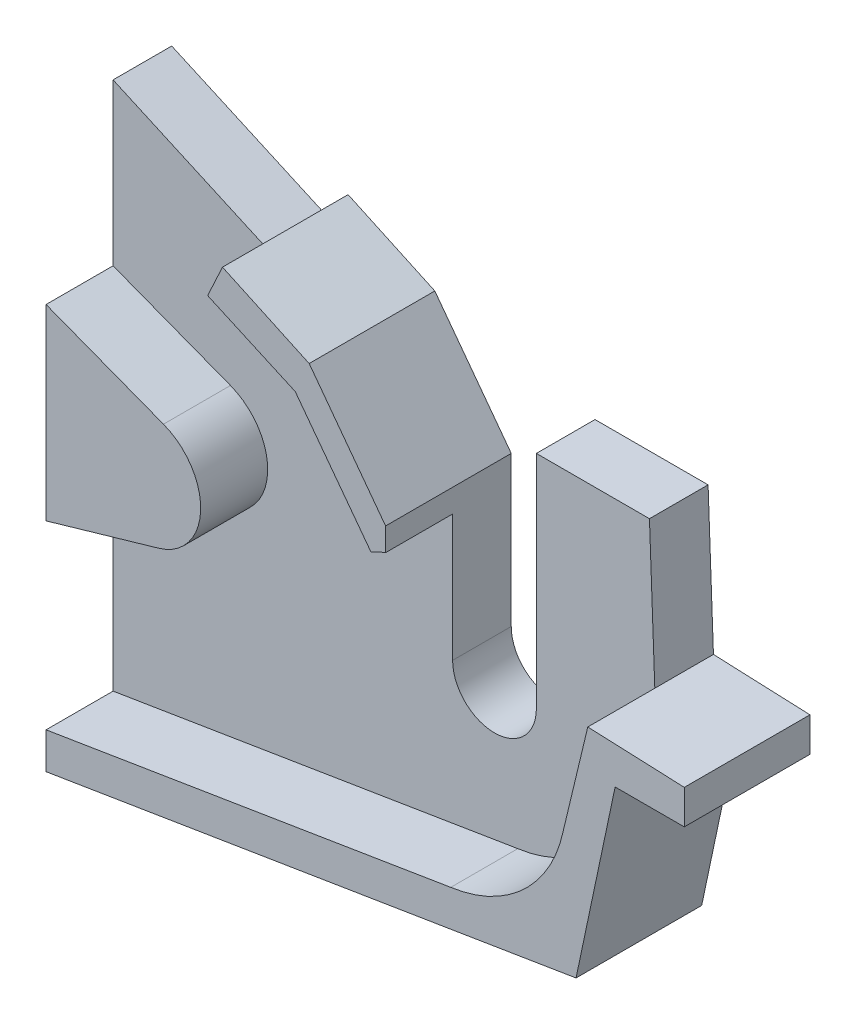
ISO-10303-21;
HEADER;
FILE_DESCRIPTION(('STEP AP214'),'2;1');
FILE_NAME('part.step','',(''),(''),'','','');
FILE_SCHEMA(('AUTOMOTIVE_DESIGN { 1 0 10303 214 1 1 1 1 }'));
ENDSEC;
DATA;
#1=APPLICATION_CONTEXT('core data for automotive mechanical design processes');
#2=APPLICATION_PROTOCOL_DEFINITION('international standard','automotive_design',2000,#1);
#3=PRODUCT_CONTEXT('',#1,'mechanical');
#4=PRODUCT('Part','Part','',(#3));
#5=PRODUCT_RELATED_PRODUCT_CATEGORY('part','',(#4));
#6=PRODUCT_DEFINITION_FORMATION('','',#4);
#7=PRODUCT_DEFINITION_CONTEXT('part definition',#1,'design');
#8=PRODUCT_DEFINITION('design','',#6,#7);
#9=PRODUCT_DEFINITION_SHAPE('','',#8);
#10=(LENGTH_UNIT() NAMED_UNIT(*) SI_UNIT(.MILLI.,.METRE.));
#11=(NAMED_UNIT(*) PLANE_ANGLE_UNIT() SI_UNIT($,.RADIAN.));
#12=(NAMED_UNIT(*) SI_UNIT($,.STERADIAN.) SOLID_ANGLE_UNIT());
#13=UNCERTAINTY_MEASURE_WITH_UNIT(LENGTH_MEASURE(1.E-05),#10,'distance_accuracy_value','');
#14=(GEOMETRIC_REPRESENTATION_CONTEXT(3) GLOBAL_UNCERTAINTY_ASSIGNED_CONTEXT((#13)) GLOBAL_UNIT_ASSIGNED_CONTEXT((#10,
#11,#12)) REPRESENTATION_CONTEXT('',''));
#15=CARTESIAN_POINT('',(0.,0.,0.));
#16=DIRECTION('',(0.,0.,1.));
#17=DIRECTION('',(1.,0.,0.));
#18=AXIS2_PLACEMENT_3D('',#15,#16,#17);
#19=CARTESIAN_POINT('',(0.,0.,7.));
#20=DIRECTION('',(0.,0.,1.));
#21=DIRECTION('',(1.,0.,0.));
#22=AXIS2_PLACEMENT_3D('',#19,#20,#21);
#23=PLANE('',#22);
#24=DIRECTION('',(-0.986991690227506,-0.160771276731423,0.));
#25=VECTOR('',#24,1.);
#26=CARTESIAN_POINT('',(2.22802353362368,-13.6780696031388,7.));
#27=LINE('',#26,#25);
#28=CARTESIAN_POINT('',(6.86912561146139,-12.9220795437668,7.));
#29=VERTEX_POINT('',#28);
#30=CARTESIAN_POINT('',(-41.4462123020663,-20.7921747421138,7.));
#31=VERTEX_POINT('',#30);
#32=EDGE_CURVE('E320',#29,#31,#27,.T.);
#33=ORIENTED_EDGE('',*,*,#32,.F.);
#34=CARTESIAN_POINT('',(4.68782168795325,2.86623605071615,7.));
#35=DIRECTION('',(0.,0.,1.));
#36=DIRECTION('',(1.,0.,0.));
#37=AXIS2_PLACEMENT_3D('',#34,#35,#36);
#38=CIRCLE('',#37,15.9382871136676);
#39=CARTESIAN_POINT('',(20.2892733707284,-0.393165966178356,7.));
#40=VERTEX_POINT('',#39);
#41=EDGE_CURVE('E259',#40,#29,#38,.F.);
#42=ORIENTED_EDGE('',*,*,#41,.F.);
#43=DIRECTION('',(0.233360215526109,0.972390358760106,0.));
#44=VECTOR('',#43,1.);
#45=CARTESIAN_POINT('',(19.2735967393053,-4.62539621925356,7.));
#46=LINE('',#45,#44);
#47=CARTESIAN_POINT('',(23.2245967998316,11.83805432074,7.));
#48=VERTEX_POINT('',#47);
#49=EDGE_CURVE('E264',#40,#48,#46,.T.);
#50=ORIENTED_EDGE('',*,*,#49,.T.);
#51=DIRECTION('',(0.0370621633835116,-0.999312962012069,0.));
#52=VECTOR('',#51,1.);
#53=CARTESIAN_POINT('',(23.6311378714714,0.87642322878244,7.));
#54=LINE('',#53,#52);
#55=CARTESIAN_POINT('',(22.5861708374071,29.0520343287084,7.));
#56=VERTEX_POINT('',#55);
#57=EDGE_CURVE('E414',#56,#48,#54,.T.);
#58=ORIENTED_EDGE('',*,*,#57,.F.);
#59=DIRECTION('',(1.,0.,0.));
#60=VECTOR('',#59,1.);
#61=CARTESIAN_POINT('',(0.,29.0520343287084,7.));
#62=LINE('',#61,#60);
#63=CARTESIAN_POINT('',(9.0861708374071,29.0520343287084,7.));
#64=VERTEX_POINT('',#63);
#65=EDGE_CURVE('E418',#64,#56,#62,.T.);
#66=ORIENTED_EDGE('',*,*,#65,.F.);
#67=DIRECTION('',(0.,1.,0.));
#68=VECTOR('',#67,1.);
#69=CARTESIAN_POINT('',(9.0861708374071,0.,7.));
#70=LINE('',#69,#68);
#71=CARTESIAN_POINT('',(9.0861708374071,2.65462230757975,7.));
#72=VERTEX_POINT('',#71);
#73=EDGE_CURVE('E423',#72,#64,#70,.T.);
#74=ORIENTED_EDGE('',*,*,#73,.F.);
#75=CARTESIAN_POINT('',(4.0861708374071,2.65462230757975,7.));
#76=DIRECTION('',(0.,0.,1.));
#77=DIRECTION('',(1.,0.,0.));
#78=AXIS2_PLACEMENT_3D('',#75,#76,#77);
#79=CIRCLE('',#78,5.);
#80=CARTESIAN_POINT('',(-0.913829162592902,2.65462230757975,7.));
#81=VERTEX_POINT('',#80);
#82=EDGE_CURVE('E427',#81,#72,#79,.T.);
#83=ORIENTED_EDGE('',*,*,#82,.F.);
#84=DIRECTION('',(0.,1.,0.));
#85=VECTOR('',#84,1.);
#86=CARTESIAN_POINT('',(-0.913829162592902,0.,7.));
#87=LINE('',#86,#85);
#88=CARTESIAN_POINT('',(-0.913829162592902,17.7877139891202,7.));
#89=VERTEX_POINT('',#88);
#90=EDGE_CURVE('E102',#81,#89,#87,.T.);
#91=ORIENTED_EDGE('',*,*,#90,.T.);
#92=CARTESIAN_POINT('',(4.68782168795325,2.86623605071615,7.));
#93=DIRECTION('',(0.,0.,1.));
#94=DIRECTION('',(1.,0.,0.));
#95=AXIS2_PLACEMENT_3D('',#92,#93,#94);
#96=CIRCLE('',#95,15.9382871136676);
#97=CARTESIAN_POINT('',(-2.67291578952691,17.0030157372403,7.));
#98=VERTEX_POINT('',#97);
#99=EDGE_CURVE('E372',#98,#89,#96,.F.);
#100=ORIENTED_EDGE('',*,*,#99,.F.);
#101=DIRECTION('',(0.599518185561964,-0.800361134226601,0.));
#102=VECTOR('',#101,1.);
#103=CARTESIAN_POINT('',(6.44636407504535,4.82871085123035,7.));
#104=LINE('',#103,#102);
#105=CARTESIAN_POINT('',(-11.6983487532847,29.0520343287084,7.));
#106=VERTEX_POINT('',#105);
#107=EDGE_CURVE('E96',#106,#98,#104,.T.);
#108=ORIENTED_EDGE('',*,*,#107,.F.);
#109=DIRECTION('',(-0.912307213221426,0.409506469673137,0.));
#110=VECTOR('',#109,1.);
#111=CARTESIAN_POINT('',(8.89195426682854,19.8096846277857,7.));
#112=LINE('',#111,#110);
#113=CARTESIAN_POINT('',(-22.1550900037522,33.7457418120067,7.));
#114=VERTEX_POINT('',#113);
#115=EDGE_CURVE('E369',#106,#114,#112,.T.);
#116=ORIENTED_EDGE('',*,*,#115,.T.);
#117=DIRECTION('',(0.912307213221426,-0.409506469673137,0.));
#118=VECTOR('',#117,1.);
#119=CARTESIAN_POINT('',(8.89195426682854,19.8096846277857,7.));
#120=LINE('',#119,#118);
#121=CARTESIAN_POINT('',(-41.4462123020663,42.4049295000229,7.));
#122=VERTEX_POINT('',#121);
#123=EDGE_CURVE('E433',#122,#114,#120,.T.);
#124=ORIENTED_EDGE('',*,*,#123,.F.);
#125=DIRECTION('',(0.,-1.,0.));
#126=VECTOR('',#125,1.);
#127=CARTESIAN_POINT('',(-41.4462123020663,0.,7.));
#128=LINE('',#127,#126);
#129=CARTESIAN_POINT('',(-41.4462123020663,23.1809754877137,7.));
#130=VERTEX_POINT('',#129);
#131=EDGE_CURVE('E438',#122,#130,#128,.T.);
#132=ORIENTED_EDGE('',*,*,#131,.T.);
#133=DIRECTION('',(-0.933859309772782,0.357640587113241,0.));
#134=VECTOR('',#133,1.);
#135=CARTESIAN_POINT('',(2.44086913521748,6.37351701119464,7.));
#136=LINE('',#135,#134);
#137=CARTESIAN_POINT('',(-27.4304834133616,17.8133644823729,7.));
#138=VERTEX_POINT('',#137);
#139=EDGE_CURVE('E410',#138,#130,#136,.T.);
#140=ORIENTED_EDGE('',*,*,#139,.F.);
#141=CARTESIAN_POINT('',(-29.9039838978348,11.3546415678472,7.));
#142=DIRECTION('',(0.,0.,1.));
#143=DIRECTION('',(1.,0.,0.));
#144=AXIS2_PLACEMENT_3D('',#141,#142,#143);
#145=CIRCLE('',#144,6.91616268846454);
#146=CARTESIAN_POINT('',(-27.9913406044106,4.70820628527434,7.));
#147=VERTEX_POINT('',#146);
#148=EDGE_CURVE('E402',#138,#147,#145,.F.);
#149=ORIENTED_EDGE('',*,*,#148,.T.);
#150=DIRECTION('',(-0.960443575653902,-0.278474663093696,0.));
#151=VECTOR('',#150,1.);
#152=CARTESIAN_POINT('',(-3.42992943549239,11.8296352517949,7.));
#153=LINE('',#152,#151);
#154=CARTESIAN_POINT('',(-41.4462123020663,0.807049613553603,7.));
#155=VERTEX_POINT('',#154);
#156=EDGE_CURVE('E406',#147,#155,#153,.T.);
#157=ORIENTED_EDGE('',*,*,#156,.T.);
#158=EDGE_CURVE('E437',#155,#31,#128,.T.);
#159=ORIENTED_EDGE('',*,*,#158,.T.);
#160=EDGE_LOOP('',(#33,#42,#50,#58,#66,#74,#83,#91,#100,#108,#116,#124,#132,#140,#149,#157,#159));
#161=FACE_BOUND('',#160,.T.);
#162=ADVANCED_FACE('F80',(#161),#23,.T.);
#163=CARTESIAN_POINT('',(0.536724699134198,12.7901277892678,7.));
#164=DIRECTION('',(0.0419270824807038,0.999120673269579,0.));
#165=DIRECTION('',(-0.999120673269579,0.0419270824807038,0.));
#166=AXIS2_PLACEMENT_3D('',#163,#164,#165);
#167=PLANE('',#166);
#168=DIRECTION('',(0.999120673269579,-0.0419270824807038,0.));
#169=VECTOR('',#168,1.);
#170=CARTESIAN_POINT('',(0.536724699134198,12.7901277892678,0.));
#171=LINE('',#170,#169);
#172=CARTESIAN_POINT('',(23.2245967998316,11.83805432074,0.));
#173=VERTEX_POINT('',#172);
#174=CARTESIAN_POINT('',(34.744303122736,11.3546415658289,0.));
#175=VERTEX_POINT('',#174);
#176=EDGE_CURVE('E413',#173,#175,#171,.T.);
#177=ORIENTED_EDGE('',*,*,#176,.F.);
#178=DIRECTION('',(0.,0.,-1.));
#179=VECTOR('',#178,1.);
#180=CARTESIAN_POINT('',(23.2245967998316,11.83805432074,7.));
#181=LINE('',#180,#179);
#182=EDGE_CURVE('E12',#48,#173,#181,.T.);
#183=ORIENTED_EDGE('',*,*,#182,.F.);
#184=DIRECTION('',(0.,0.,-1.));
#185=VECTOR('',#184,1.);
#186=CARTESIAN_POINT('',(23.2245967998316,11.83805432074,15.));
#187=LINE('',#186,#185);
#188=CARTESIAN_POINT('',(23.2245967998316,11.83805432074,15.));
#189=VERTEX_POINT('',#188);
#190=EDGE_CURVE('E312',#189,#48,#187,.T.);
#191=ORIENTED_EDGE('',*,*,#190,.F.);
#192=DIRECTION('',(0.999120673269579,-0.0419270824807038,0.));
#193=VECTOR('',#192,1.);
#194=CARTESIAN_POINT('',(0.536724699134198,12.7901277892678,15.));
#195=LINE('',#194,#193);
#196=CARTESIAN_POINT('',(34.744303122736,11.3546415658289,15.));
#197=VERTEX_POINT('',#196);
#198=EDGE_CURVE('E303',#189,#197,#195,.T.);
#199=ORIENTED_EDGE('',*,*,#198,.T.);
#200=DIRECTION('',(0.,0.,-1.));
#201=VECTOR('',#200,1.);
#202=CARTESIAN_POINT('',(34.744303122736,11.3546415658289,7.));
#203=LINE('',#202,#201);
#204=EDGE_CURVE('E442',#197,#175,#203,.T.);
#205=ORIENTED_EDGE('',*,*,#204,.T.);
#206=EDGE_LOOP('',(#177,#183,#191,#199,#205));
#207=FACE_BOUND('',#206,.T.);
#208=ADVANCED_FACE('F82',(#207),#167,.T.);
#209=CARTESIAN_POINT('',(23.6311378714714,0.87642322878244,7.));
#210=DIRECTION('',(0.999312962012069,0.0370621633835116,0.));
#211=DIRECTION('',(-0.0370621633835116,0.999312962012069,0.));
#212=AXIS2_PLACEMENT_3D('',#209,#210,#211);
#213=PLANE('',#212);
#214=DIRECTION('',(0.0370621633835116,-0.999312962012069,0.));
#215=VECTOR('',#214,1.);
#216=CARTESIAN_POINT('',(23.6311378714714,0.87642322878244,0.));
#217=LINE('',#216,#215);
#218=CARTESIAN_POINT('',(22.5861708374071,29.0520343287084,0.));
#219=VERTEX_POINT('',#218);
#220=EDGE_CURVE('E446',#219,#173,#217,.T.);
#221=ORIENTED_EDGE('',*,*,#220,.F.);
#222=DIRECTION('',(0.,0.,-1.));
#223=VECTOR('',#222,1.);
#224=CARTESIAN_POINT('',(22.5861708374071,29.0520343287084,7.));
#225=LINE('',#224,#223);
#226=EDGE_CURVE('E89',#56,#219,#225,.T.);
#227=ORIENTED_EDGE('',*,*,#226,.F.);
#228=ORIENTED_EDGE('',*,*,#57,.T.);
#229=ORIENTED_EDGE('',*,*,#182,.T.);
#230=EDGE_LOOP('',(#221,#227,#228,#229));
#231=FACE_BOUND('',#230,.T.);
#232=ADVANCED_FACE('F546',(#231),#213,.T.);
#233=CARTESIAN_POINT('',(0.,29.0520343287084,7.));
#234=DIRECTION('',(0.,1.,0.));
#235=DIRECTION('',(0.,0.,1.));
#236=AXIS2_PLACEMENT_3D('',#233,#234,#235);
#237=PLANE('',#236);
#238=DIRECTION('',(1.,0.,0.));
#239=VECTOR('',#238,1.);
#240=CARTESIAN_POINT('',(0.,29.0520343287084,0.));
#241=LINE('',#240,#239);
#242=CARTESIAN_POINT('',(9.0861708374071,29.0520343287084,0.));
#243=VERTEX_POINT('',#242);
#244=EDGE_CURVE('E450',#243,#219,#241,.T.);
#245=ORIENTED_EDGE('',*,*,#244,.F.);
#246=DIRECTION('',(0.,0.,-1.));
#247=VECTOR('',#246,1.);
#248=CARTESIAN_POINT('',(9.0861708374071,29.0520343287084,7.));
#249=LINE('',#248,#247);
#250=EDGE_CURVE('E536',#64,#243,#249,.T.);
#251=ORIENTED_EDGE('',*,*,#250,.F.);
#252=ORIENTED_EDGE('',*,*,#65,.T.);
#253=ORIENTED_EDGE('',*,*,#226,.T.);
#254=EDGE_LOOP('',(#245,#251,#252,#253));
#255=FACE_BOUND('',#254,.T.);
#256=ADVANCED_FACE('F542',(#255),#237,.T.);
#257=CARTESIAN_POINT('',(9.0861708374071,0.,7.));
#258=DIRECTION('',(-1.,0.,0.));
#259=DIRECTION('',(0.,0.,1.));
#260=AXIS2_PLACEMENT_3D('',#257,#258,#259);
#261=PLANE('',#260);
#262=DIRECTION('',(0.,1.,0.));
#263=VECTOR('',#262,1.);
#264=CARTESIAN_POINT('',(9.0861708374071,0.,0.));
#265=LINE('',#264,#263);
#266=CARTESIAN_POINT('',(9.0861708374071,2.65462230757975,0.));
#267=VERTEX_POINT('',#266);
#268=EDGE_CURVE('E454',#267,#243,#265,.T.);
#269=ORIENTED_EDGE('',*,*,#268,.F.);
#270=DIRECTION('',(0.,0.,-1.));
#271=VECTOR('',#270,1.);
#272=CARTESIAN_POINT('',(9.0861708374071,2.65462230757975,7.));
#273=LINE('',#272,#271);
#274=EDGE_CURVE('E533',#72,#267,#273,.T.);
#275=ORIENTED_EDGE('',*,*,#274,.F.);
#276=ORIENTED_EDGE('',*,*,#73,.T.);
#277=ORIENTED_EDGE('',*,*,#250,.T.);
#278=EDGE_LOOP('',(#269,#275,#276,#277));
#279=FACE_BOUND('',#278,.T.);
#280=ADVANCED_FACE('F556',(#279),#261,.T.);
#281=CARTESIAN_POINT('',(4.0861708374071,2.65462230757975,7.));
#282=DIRECTION('',(0.,0.,-1.));
#283=DIRECTION('',(-1.,0.,0.));
#284=AXIS2_PLACEMENT_3D('',#281,#282,#283);
#285=CYLINDRICAL_SURFACE('',#284,5.);
#286=CARTESIAN_POINT('',(4.0861708374071,2.65462230757975,0.));
#287=DIRECTION('',(0.,0.,1.));
#288=DIRECTION('',(1.,0.,0.));
#289=AXIS2_PLACEMENT_3D('',#286,#287,#288);
#290=CIRCLE('',#289,5.);
#291=CARTESIAN_POINT('',(-0.913829162592902,2.65462230757975,0.));
#292=VERTEX_POINT('',#291);
#293=EDGE_CURVE('E458',#292,#267,#290,.T.);
#294=ORIENTED_EDGE('',*,*,#293,.F.);
#295=DIRECTION('',(0.,0.,-1.));
#296=VECTOR('',#295,1.);
#297=CARTESIAN_POINT('',(-0.913829162592902,2.65462230757975,7.));
#298=LINE('',#297,#296);
#299=EDGE_CURVE('E530',#81,#292,#298,.T.);
#300=ORIENTED_EDGE('',*,*,#299,.F.);
#301=ORIENTED_EDGE('',*,*,#82,.T.);
#302=ORIENTED_EDGE('',*,*,#274,.T.);
#303=EDGE_LOOP('',(#294,#300,#301,#302));
#304=FACE_BOUND('',#303,.T.);
#305=ADVANCED_FACE('F603',(#304),#285,.F.);
#306=CARTESIAN_POINT('',(-0.913829162592902,0.,7.));
#307=DIRECTION('',(-1.,0.,0.));
#308=DIRECTION('',(0.,0.,1.));
#309=AXIS2_PLACEMENT_3D('',#306,#307,#308);
#310=PLANE('',#309);
#311=DIRECTION('',(0.,1.,0.));
#312=VECTOR('',#311,1.);
#313=CARTESIAN_POINT('',(-0.913829162592902,0.,0.));
#314=LINE('',#313,#312);
#315=CARTESIAN_POINT('',(-0.913829162592902,20.5504620382955,0.));
#316=VERTEX_POINT('',#315);
#317=EDGE_CURVE('E462',#292,#316,#314,.T.);
#318=ORIENTED_EDGE('',*,*,#317,.T.);
#319=DIRECTION('',(0.,0.,-1.));
#320=VECTOR('',#319,1.);
#321=CARTESIAN_POINT('',(-0.913829162592902,20.5504620382955,7.));
#322=LINE('',#321,#320);
#323=CARTESIAN_POINT('',(-0.913829162592902,20.5504620382955,15.));
#324=VERTEX_POINT('',#323);
#325=EDGE_CURVE('E526',#324,#316,#322,.T.);
#326=ORIENTED_EDGE('',*,*,#325,.F.);
#327=DIRECTION('',(0.,1.,0.));
#328=VECTOR('',#327,1.);
#329=CARTESIAN_POINT('',(-0.913829162592902,0.,15.));
#330=LINE('',#329,#328);
#331=CARTESIAN_POINT('',(-0.913829162592902,17.7877139891202,15.));
#332=VERTEX_POINT('',#331);
#333=EDGE_CURVE('E329',#332,#324,#330,.T.);
#334=ORIENTED_EDGE('',*,*,#333,.F.);
#335=DIRECTION('',(0.,0.,-1.));
#336=VECTOR('',#335,1.);
#337=CARTESIAN_POINT('',(-0.913829162592902,17.7877139891202,15.));
#338=LINE('',#337,#336);
#339=EDGE_CURVE('E363',#332,#89,#338,.T.);
#340=ORIENTED_EDGE('',*,*,#339,.T.);
#341=ORIENTED_EDGE('',*,*,#90,.F.);
#342=ORIENTED_EDGE('',*,*,#299,.T.);
#343=EDGE_LOOP('',(#318,#326,#334,#340,#341,#342));
#344=FACE_BOUND('',#343,.T.);
#345=ADVANCED_FACE('F604',(#344),#310,.F.);
#346=CARTESIAN_POINT('',(9.26114189402648,6.90647430874386,7.));
#347=DIRECTION('',(-0.801633281882219,-0.597816093275133,0.));
#348=DIRECTION('',(0.597816093275133,-0.801633281882219,0.));
#349=AXIS2_PLACEMENT_3D('',#346,#347,#348);
#350=PLANE('',#349);
#351=DIRECTION('',(-0.597816093275133,0.801633281882219,0.));
#352=VECTOR('',#351,1.);
#353=CARTESIAN_POINT('',(9.26114189402648,6.90647430874386,0.));
#354=LINE('',#353,#352);
#355=CARTESIAN_POINT('',(-10.0368202056355,32.7838116129957,0.));
#356=VERTEX_POINT('',#355);
#357=EDGE_CURVE('E465',#316,#356,#354,.T.);
#358=ORIENTED_EDGE('',*,*,#357,.T.);
#359=DIRECTION('',(0.,0.,-1.));
#360=VECTOR('',#359,1.);
#361=CARTESIAN_POINT('',(-10.0368202056355,32.7838116129957,7.));
#362=LINE('',#361,#360);
#363=CARTESIAN_POINT('',(-10.0368202056355,32.7838116129957,15.));
#364=VERTEX_POINT('',#363);
#365=EDGE_CURVE('E522',#364,#356,#362,.T.);
#366=ORIENTED_EDGE('',*,*,#365,.F.);
#367=DIRECTION('',(-0.597816093275133,0.801633281882219,0.));
#368=VECTOR('',#367,1.);
#369=CARTESIAN_POINT('',(9.26114189402648,6.90647430874386,15.));
#370=LINE('',#369,#368);
#371=EDGE_CURVE('E333',#324,#364,#370,.T.);
#372=ORIENTED_EDGE('',*,*,#371,.F.);
#373=ORIENTED_EDGE('',*,*,#325,.T.);
#374=EDGE_LOOP('',(#358,#366,#372,#373));
#375=FACE_BOUND('',#374,.T.);
#376=ADVANCED_FACE('F600',(#375),#350,.F.);
#377=CARTESIAN_POINT('',(10.7214720768776,23.1841900245257,7.));
#378=DIRECTION('',(-0.419738295272975,-0.907645174879114,0.));
#379=DIRECTION('',(0.907645174879114,-0.419738295272975,0.));
#380=AXIS2_PLACEMENT_3D('',#377,#378,#379);
#381=PLANE('',#380);
#382=DIRECTION('',(-0.907645174879114,0.419738295272975,0.));
#383=VECTOR('',#382,1.);
#384=CARTESIAN_POINT('',(10.7214720768776,23.1841900245257,0.));
#385=LINE('',#384,#383);
#386=CARTESIAN_POINT('',(-20.3865602199569,37.5700236156193,0.));
#387=VERTEX_POINT('',#386);
#388=EDGE_CURVE('E468',#356,#387,#385,.T.);
#389=ORIENTED_EDGE('',*,*,#388,.T.);
#390=DIRECTION('',(0.,0.,-1.));
#391=VECTOR('',#390,1.);
#392=CARTESIAN_POINT('',(-20.3865602199569,37.5700236156193,7.));
#393=LINE('',#392,#391);
#394=CARTESIAN_POINT('',(-20.3865602199569,37.5700236156193,15.));
#395=VERTEX_POINT('',#394);
#396=EDGE_CURVE('E518',#395,#387,#393,.T.);
#397=ORIENTED_EDGE('',*,*,#396,.F.);
#398=DIRECTION('',(-0.907645174879114,0.419738295272975,0.));
#399=VECTOR('',#398,1.);
#400=CARTESIAN_POINT('',(10.7214720768776,23.1841900245257,15.));
#401=LINE('',#400,#399);
#402=EDGE_CURVE('E337',#364,#395,#401,.T.);
#403=ORIENTED_EDGE('',*,*,#402,.F.);
#404=ORIENTED_EDGE('',*,*,#365,.T.);
#405=EDGE_LOOP('',(#389,#397,#403,#404));
#406=FACE_BOUND('',#405,.T.);
#407=ADVANCED_FACE('F593',(#406),#381,.F.);
#408=CARTESIAN_POINT('',(-31.1080322968345,14.3858335910936,7.));
#409=DIRECTION('',(0.907645174879114,-0.419738295272975,0.));
#410=DIRECTION('',(0.419738295272975,0.907645174879114,0.));
#411=AXIS2_PLACEMENT_3D('',#408,#409,#410);
#412=PLANE('',#411);
#413=DIRECTION('',(-0.419738295272975,-0.907645174879114,0.));
#414=VECTOR('',#413,1.);
#415=CARTESIAN_POINT('',(-31.1080322968345,14.3858335910936,0.));
#416=LINE('',#415,#414);
#417=CARTESIAN_POINT('',(-22.1550900037522,33.7457418120067,0.));
#418=VERTEX_POINT('',#417);
#419=EDGE_CURVE('E471',#387,#418,#416,.T.);
#420=ORIENTED_EDGE('',*,*,#419,.T.);
#421=DIRECTION('',(0.,0.,-1.));
#422=VECTOR('',#421,1.);
#423=CARTESIAN_POINT('',(-22.1550900037522,33.7457418120067,7.));
#424=LINE('',#423,#422);
#425=EDGE_CURVE('E515',#114,#418,#424,.T.);
#426=ORIENTED_EDGE('',*,*,#425,.F.);
#427=DIRECTION('',(0.,0.,-1.));
#428=VECTOR('',#427,1.);
#429=CARTESIAN_POINT('',(-22.1550900037522,33.7457418120067,15.));
#430=LINE('',#429,#428);
#431=CARTESIAN_POINT('',(-22.1550900037522,33.7457418120067,15.));
#432=VERTEX_POINT('',#431);
#433=EDGE_CURVE('E359',#432,#114,#430,.T.);
#434=ORIENTED_EDGE('',*,*,#433,.F.);
#435=DIRECTION('',(-0.419738295272975,-0.907645174879114,0.));
#436=VECTOR('',#435,1.);
#437=CARTESIAN_POINT('',(-31.1080322968345,14.3858335910936,15.));
#438=LINE('',#437,#436);
#439=EDGE_CURVE('E341',#395,#432,#438,.T.);
#440=ORIENTED_EDGE('',*,*,#439,.F.);
#441=ORIENTED_EDGE('',*,*,#396,.T.);
#442=EDGE_LOOP('',(#420,#426,#434,#440,#441));
#443=FACE_BOUND('',#442,.T.);
#444=ADVANCED_FACE('F588',(#443),#412,.F.);
#445=CARTESIAN_POINT('',(8.89195426682854,19.8096846277857,7.));
#446=DIRECTION('',(0.409506469673137,0.912307213221426,0.));
#447=DIRECTION('',(-0.912307213221426,0.409506469673137,0.));
#448=AXIS2_PLACEMENT_3D('',#445,#446,#447);
#449=PLANE('',#448);
#450=DIRECTION('',(0.912307213221426,-0.409506469673137,0.));
#451=VECTOR('',#450,1.);
#452=CARTESIAN_POINT('',(8.89195426682854,19.8096846277857,0.));
#453=LINE('',#452,#451);
#454=CARTESIAN_POINT('',(-41.4462123020663,42.4049295000229,0.));
#455=VERTEX_POINT('',#454);
#456=EDGE_CURVE('E475',#455,#418,#453,.T.);
#457=ORIENTED_EDGE('',*,*,#456,.F.);
#458=DIRECTION('',(0.,0.,-1.));
#459=VECTOR('',#458,1.);
#460=CARTESIAN_POINT('',(-41.4462123020663,42.4049295000229,7.));
#461=LINE('',#460,#459);
#462=EDGE_CURVE('E512',#122,#455,#461,.T.);
#463=ORIENTED_EDGE('',*,*,#462,.F.);
#464=ORIENTED_EDGE('',*,*,#123,.T.);
#465=ORIENTED_EDGE('',*,*,#425,.T.);
#466=EDGE_LOOP('',(#457,#463,#464,#465));
#467=FACE_BOUND('',#466,.T.);
#468=ADVANCED_FACE('F582',(#467),#449,.T.);
#469=CARTESIAN_POINT('',(-41.4462123020663,0.,7.));
#470=DIRECTION('',(1.,0.,0.));
#471=DIRECTION('',(0.,1.,0.));
#472=AXIS2_PLACEMENT_3D('',#469,#470,#471);
#473=PLANE('',#472);
#474=DIRECTION('',(0.,-1.,0.));
#475=VECTOR('',#474,1.);
#476=CARTESIAN_POINT('',(-41.4462123020663,0.,0.));
#477=LINE('',#476,#475);
#478=CARTESIAN_POINT('',(-41.4462123020663,-25.1234009808684,0.));
#479=VERTEX_POINT('',#478);
#480=EDGE_CURVE('E479',#455,#479,#477,.T.);
#481=ORIENTED_EDGE('',*,*,#480,.T.);
#482=DIRECTION('',(0.,0.,-1.));
#483=VECTOR('',#482,1.);
#484=CARTESIAN_POINT('',(-41.4462123020663,-25.1234009808684,7.));
#485=LINE('',#484,#483);
#486=CARTESIAN_POINT('',(-41.4462123020663,-25.1234009808684,15.));
#487=VERTEX_POINT('',#486);
#488=EDGE_CURVE('E508',#487,#479,#485,.T.);
#489=ORIENTED_EDGE('',*,*,#488,.F.);
#490=DIRECTION('',(0.,-1.,0.));
#491=VECTOR('',#490,1.);
#492=CARTESIAN_POINT('',(-41.4462123020663,0.,15.));
#493=LINE('',#492,#491);
#494=CARTESIAN_POINT('',(-41.4462123020663,-20.7921747421138,15.));
#495=VERTEX_POINT('',#494);
#496=EDGE_CURVE('E282',#495,#487,#493,.T.);
#497=ORIENTED_EDGE('',*,*,#496,.F.);
#498=DIRECTION('',(0.,0.,-1.));
#499=VECTOR('',#498,1.);
#500=CARTESIAN_POINT('',(-41.4462123020663,-20.7921747421138,15.));
#501=LINE('',#500,#499);
#502=EDGE_CURVE('E265',#495,#31,#501,.T.);
#503=ORIENTED_EDGE('',*,*,#502,.T.);
#504=ORIENTED_EDGE('',*,*,#158,.F.);
#505=DIRECTION('',(0.,0.,-1.));
#506=VECTOR('',#505,1.);
#507=CARTESIAN_POINT('',(-41.4462123020663,0.807049613553603,15.));
#508=LINE('',#507,#506);
#509=CARTESIAN_POINT('',(-41.4462123020663,0.807049613553603,15.));
#510=VERTEX_POINT('',#509);
#511=EDGE_CURVE('E395',#510,#155,#508,.T.);
#512=ORIENTED_EDGE('',*,*,#511,.F.);
#513=DIRECTION('',(0.,-1.,0.));
#514=VECTOR('',#513,1.);
#515=CARTESIAN_POINT('',(-41.4462123020663,0.,15.));
#516=LINE('',#515,#514);
#517=CARTESIAN_POINT('',(-41.4462123020663,23.1809754877137,15.));
#518=VERTEX_POINT('',#517);
#519=EDGE_CURVE('E379',#518,#510,#516,.T.);
#520=ORIENTED_EDGE('',*,*,#519,.F.);
#521=DIRECTION('',(0.,0.,-1.));
#522=VECTOR('',#521,1.);
#523=CARTESIAN_POINT('',(-41.4462123020663,23.1809754877137,15.));
#524=LINE('',#523,#522);
#525=EDGE_CURVE('E398',#518,#130,#524,.T.);
#526=ORIENTED_EDGE('',*,*,#525,.T.);
#527=ORIENTED_EDGE('',*,*,#131,.F.);
#528=ORIENTED_EDGE('',*,*,#462,.T.);
#529=EDGE_LOOP('',(#481,#489,#497,#503,#504,#512,#520,#526,#527,#528));
#530=FACE_BOUND('',#529,.T.);
#531=ADVANCED_FACE('F578',(#530),#473,.F.);
#532=CARTESIAN_POINT('',(2.9153021414019,-17.8973448899889,7.));
#533=DIRECTION('',(-0.160771276731423,0.986991690227506,0.));
#534=DIRECTION('',(-0.986991690227506,-0.160771276731423,0.));
#535=AXIS2_PLACEMENT_3D('',#532,#533,#534);
#536=PLANE('',#535);
#537=DIRECTION('',(0.986991690227506,0.160771276731423,0.));
#538=VECTOR('',#537,1.);
#539=CARTESIAN_POINT('',(2.9153021414019,-17.8973448899889,0.));
#540=LINE('',#539,#538);
#541=CARTESIAN_POINT('',(21.8226728247008,-14.8175194421297,0.));
#542=VERTEX_POINT('',#541);
#543=EDGE_CURVE('E482',#479,#542,#540,.T.);
#544=ORIENTED_EDGE('',*,*,#543,.T.);
#545=DIRECTION('',(0.,0.,-1.));
#546=VECTOR('',#545,1.);
#547=CARTESIAN_POINT('',(21.8226728247008,-14.8175194421297,7.));
#548=LINE('',#547,#546);
#549=CARTESIAN_POINT('',(21.8226728247008,-14.8175194421297,15.));
#550=VERTEX_POINT('',#549);
#551=EDGE_CURVE('E504',#550,#542,#548,.T.);
#552=ORIENTED_EDGE('',*,*,#551,.F.);
#553=DIRECTION('',(0.986991690227506,0.160771276731423,0.));
#554=VECTOR('',#553,1.);
#555=CARTESIAN_POINT('',(2.9153021414019,-17.8973448899889,15.));
#556=LINE('',#555,#554);
#557=EDGE_CURVE('E285',#487,#550,#556,.T.);
#558=ORIENTED_EDGE('',*,*,#557,.F.);
#559=ORIENTED_EDGE('',*,*,#488,.T.);
#560=EDGE_LOOP('',(#544,#552,#558,#559));
#561=FACE_BOUND('',#560,.T.);
#562=ADVANCED_FACE('F576',(#561),#536,.F.);
#563=CARTESIAN_POINT('',(23.8872555836264,-5.04814442659853,7.));
#564=DIRECTION('',(-0.97839056027552,0.206765353876691,0.));
#565=DIRECTION('',(-0.206765353876691,-0.97839056027552,0.));
#566=AXIS2_PLACEMENT_3D('',#563,#564,#565);
#567=PLANE('',#566);
#568=DIRECTION('',(0.206765353876691,0.97839056027552,0.));
#569=VECTOR('',#568,1.);
#570=CARTESIAN_POINT('',(23.8872555836264,-5.04814442659853,0.));
#571=LINE('',#570,#569);
#572=CARTESIAN_POINT('',(26.4898011963491,7.26681072634678,0.));
#573=VERTEX_POINT('',#572);
#574=EDGE_CURVE('E485',#542,#573,#571,.T.);
#575=ORIENTED_EDGE('',*,*,#574,.T.);
#576=DIRECTION('',(0.,0.,-1.));
#577=VECTOR('',#576,1.);
#578=CARTESIAN_POINT('',(26.4898011963491,7.26681072634678,7.));
#579=LINE('',#578,#577);
#580=CARTESIAN_POINT('',(26.4898011963491,7.26681072634678,15.));
#581=VERTEX_POINT('',#580);
#582=EDGE_CURVE('E500',#581,#573,#579,.T.);
#583=ORIENTED_EDGE('',*,*,#582,.F.);
#584=DIRECTION('',(0.206765353876691,0.97839056027552,0.));
#585=VECTOR('',#584,1.);
#586=CARTESIAN_POINT('',(23.8872555836264,-5.04814442659853,15.));
#587=LINE('',#586,#585);
#588=EDGE_CURVE('E291',#550,#581,#587,.T.);
#589=ORIENTED_EDGE('',*,*,#588,.F.);
#590=ORIENTED_EDGE('',*,*,#551,.T.);
#591=EDGE_LOOP('',(#575,#583,#589,#590));
#592=FACE_BOUND('',#591,.T.);
#593=ADVANCED_FACE('F572',(#592),#567,.F.);
#594=CARTESIAN_POINT('',(0.,7.26681072634678,7.));
#595=DIRECTION('',(0.,1.,0.));
#596=DIRECTION('',(0.,0.,1.));
#597=AXIS2_PLACEMENT_3D('',#594,#595,#596);
#598=PLANE('',#597);
#599=DIRECTION('',(1.,0.,0.));
#600=VECTOR('',#599,1.);
#601=CARTESIAN_POINT('',(0.,7.26681072634678,0.));
#602=LINE('',#601,#600);
#603=CARTESIAN_POINT('',(34.744303122736,7.26681072634678,0.));
#604=VERTEX_POINT('',#603);
#605=EDGE_CURVE('E488',#573,#604,#602,.T.);
#606=ORIENTED_EDGE('',*,*,#605,.T.);
#607=DIRECTION('',(0.,0.,-1.));
#608=VECTOR('',#607,1.);
#609=CARTESIAN_POINT('',(34.744303122736,7.26681072634678,7.));
#610=LINE('',#609,#608);
#611=CARTESIAN_POINT('',(34.744303122736,7.26681072634678,15.));
#612=VERTEX_POINT('',#611);
#613=EDGE_CURVE('E496',#612,#604,#610,.T.);
#614=ORIENTED_EDGE('',*,*,#613,.F.);
#615=DIRECTION('',(1.,0.,0.));
#616=VECTOR('',#615,1.);
#617=CARTESIAN_POINT('',(0.,7.26681072634678,15.));
#618=LINE('',#617,#616);
#619=EDGE_CURVE('E295',#581,#612,#618,.T.);
#620=ORIENTED_EDGE('',*,*,#619,.F.);
#621=ORIENTED_EDGE('',*,*,#582,.T.);
#622=EDGE_LOOP('',(#606,#614,#620,#621));
#623=FACE_BOUND('',#622,.T.);
#624=ADVANCED_FACE('F568',(#623),#598,.F.);
#625=CARTESIAN_POINT('',(34.744303122736,0.,7.));
#626=DIRECTION('',(-1.,0.,0.));
#627=DIRECTION('',(0.,0.,1.));
#628=AXIS2_PLACEMENT_3D('',#625,#626,#627);
#629=PLANE('',#628);
#630=DIRECTION('',(0.,1.,0.));
#631=VECTOR('',#630,1.);
#632=CARTESIAN_POINT('',(34.744303122736,0.,0.));
#633=LINE('',#632,#631);
#634=EDGE_CURVE('E419',#604,#175,#633,.T.);
#635=ORIENTED_EDGE('',*,*,#634,.T.);
#636=ORIENTED_EDGE('',*,*,#204,.F.);
#637=DIRECTION('',(0.,1.,0.));
#638=VECTOR('',#637,1.);
#639=CARTESIAN_POINT('',(34.744303122736,0.,15.));
#640=LINE('',#639,#638);
#641=EDGE_CURVE('E299',#612,#197,#640,.T.);
#642=ORIENTED_EDGE('',*,*,#641,.F.);
#643=ORIENTED_EDGE('',*,*,#613,.T.);
#644=EDGE_LOOP('',(#635,#636,#642,#643));
#645=FACE_BOUND('',#644,.T.);
#646=ADVANCED_FACE('F564',(#645),#629,.F.);
#647=CARTESIAN_POINT('',(0.,0.,0.));
#648=DIRECTION('',(0.,0.,1.));
#649=DIRECTION('',(1.,0.,0.));
#650=AXIS2_PLACEMENT_3D('',#647,#648,#649);
#651=PLANE('',#650);
#652=ORIENTED_EDGE('',*,*,#543,.F.);
#653=ORIENTED_EDGE('',*,*,#480,.F.);
#654=ORIENTED_EDGE('',*,*,#456,.T.);
#655=ORIENTED_EDGE('',*,*,#419,.F.);
#656=ORIENTED_EDGE('',*,*,#388,.F.);
#657=ORIENTED_EDGE('',*,*,#357,.F.);
#658=ORIENTED_EDGE('',*,*,#317,.F.);
#659=ORIENTED_EDGE('',*,*,#293,.T.);
#660=ORIENTED_EDGE('',*,*,#268,.T.);
#661=ORIENTED_EDGE('',*,*,#244,.T.);
#662=ORIENTED_EDGE('',*,*,#220,.T.);
#663=ORIENTED_EDGE('',*,*,#176,.T.);
#664=ORIENTED_EDGE('',*,*,#634,.F.);
#665=ORIENTED_EDGE('',*,*,#605,.F.);
#666=ORIENTED_EDGE('',*,*,#574,.F.);
#667=EDGE_LOOP('',(#652,#653,#654,#655,#656,#657,#658,#659,#660,#661,#662,#663,#664,#665,#666));
#668=FACE_BOUND('',#667,.T.);
#669=ADVANCED_FACE('F551',(#668),#651,.F.);
#670=CARTESIAN_POINT('',(2.44086913521748,6.37351701119464,15.));
#671=DIRECTION('',(0.357640587113241,0.933859309772782,0.));
#672=DIRECTION('',(-0.933859309772782,0.357640587113241,0.));
#673=AXIS2_PLACEMENT_3D('',#670,#671,#672);
#674=PLANE('',#673);
#675=DIRECTION('',(0.,0.,-1.));
#676=VECTOR('',#675,1.);
#677=CARTESIAN_POINT('',(-27.4304834133616,17.8133644823729,15.));
#678=LINE('',#677,#676);
#679=CARTESIAN_POINT('',(-27.4304834133616,17.8133644823729,15.));
#680=VERTEX_POINT('',#679);
#681=EDGE_CURVE('E388',#680,#138,#678,.T.);
#682=ORIENTED_EDGE('',*,*,#681,.T.);
#683=ORIENTED_EDGE('',*,*,#139,.T.);
#684=ORIENTED_EDGE('',*,*,#525,.F.);
#685=DIRECTION('',(0.933859309772782,-0.357640587113241,0.));
#686=VECTOR('',#685,1.);
#687=CARTESIAN_POINT('',(2.44086913521748,6.37351701119464,15.));
#688=LINE('',#687,#686);
#689=EDGE_CURVE('E375',#518,#680,#688,.T.);
#690=ORIENTED_EDGE('',*,*,#689,.T.);
#691=EDGE_LOOP('',(#682,#683,#684,#690));
#692=FACE_BOUND('',#691,.T.);
#693=ADVANCED_FACE('F616',(#692),#674,.T.);
#694=CARTESIAN_POINT('',(-3.42992943549239,11.8296352517949,15.));
#695=DIRECTION('',(-0.278474663093696,0.960443575653902,0.));
#696=DIRECTION('',(-0.960443575653902,-0.278474663093696,0.));
#697=AXIS2_PLACEMENT_3D('',#694,#695,#696);
#698=PLANE('',#697);
#699=ORIENTED_EDGE('',*,*,#156,.F.);
#700=DIRECTION('',(0.,0.,-1.));
#701=VECTOR('',#700,1.);
#702=CARTESIAN_POINT('',(-27.9913406044106,4.70820628527435,15.));
#703=LINE('',#702,#701);
#704=CARTESIAN_POINT('',(-27.9913406044106,4.70820628527435,15.));
#705=VERTEX_POINT('',#704);
#706=EDGE_CURVE('E392',#705,#147,#703,.T.);
#707=ORIENTED_EDGE('',*,*,#706,.F.);
#708=DIRECTION('',(0.960443575653902,0.278474663093696,0.));
#709=VECTOR('',#708,1.);
#710=CARTESIAN_POINT('',(-3.42992943549239,11.8296352517949,15.));
#711=LINE('',#710,#709);
#712=EDGE_CURVE('E382',#510,#705,#711,.T.);
#713=ORIENTED_EDGE('',*,*,#712,.F.);
#714=ORIENTED_EDGE('',*,*,#511,.T.);
#715=EDGE_LOOP('',(#699,#707,#713,#714));
#716=FACE_BOUND('',#715,.T.);
#717=ADVANCED_FACE('F631',(#716),#698,.F.);
#718=CARTESIAN_POINT('',(-29.9039838978348,11.3546415678472,15.));
#719=DIRECTION('',(0.,0.,-1.));
#720=DIRECTION('',(-1.,0.,0.));
#721=AXIS2_PLACEMENT_3D('',#718,#719,#720);
#722=CYLINDRICAL_SURFACE('',#721,6.91616268846454);
#723=ORIENTED_EDGE('',*,*,#148,.F.);
#724=ORIENTED_EDGE('',*,*,#681,.F.);
#725=CARTESIAN_POINT('',(-29.9039838978348,11.3546415678472,15.));
#726=DIRECTION('',(0.,0.,1.));
#727=DIRECTION('',(1.,0.,0.));
#728=AXIS2_PLACEMENT_3D('',#725,#726,#727);
#729=CIRCLE('',#728,6.91616268846454);
#730=EDGE_CURVE('E385',#705,#680,#729,.T.);
#731=ORIENTED_EDGE('',*,*,#730,.F.);
#732=ORIENTED_EDGE('',*,*,#706,.T.);
#733=EDGE_LOOP('',(#723,#724,#731,#732));
#734=FACE_BOUND('',#733,.T.);
#735=ADVANCED_FACE('F628',(#734),#722,.T.);
#736=CARTESIAN_POINT('',(0.,0.,15.));
#737=DIRECTION('',(0.,0.,1.));
#738=DIRECTION('',(1.,0.,0.));
#739=AXIS2_PLACEMENT_3D('',#736,#737,#738);
#740=PLANE('',#739);
#741=ORIENTED_EDGE('',*,*,#689,.F.);
#742=ORIENTED_EDGE('',*,*,#519,.T.);
#743=ORIENTED_EDGE('',*,*,#712,.T.);
#744=ORIENTED_EDGE('',*,*,#730,.T.);
#745=EDGE_LOOP('',(#741,#742,#743,#744));
#746=FACE_BOUND('',#745,.T.);
#747=ADVANCED_FACE('F624',(#746),#740,.T.);
#748=CARTESIAN_POINT('',(4.68782168795325,2.86623605071615,15.));
#749=DIRECTION('',(0.,0.,-1.));
#750=DIRECTION('',(-1.,0.,0.));
#751=AXIS2_PLACEMENT_3D('',#748,#749,#750);
#752=CYLINDRICAL_SURFACE('',#751,15.9382871136676);
#753=DIRECTION('',(0.,0.,-1.));
#754=VECTOR('',#753,1.);
#755=CARTESIAN_POINT('',(-2.67291578952691,17.0030157372403,15.));
#756=LINE('',#755,#754);
#757=CARTESIAN_POINT('',(-2.67291578952691,17.0030157372403,15.));
#758=VERTEX_POINT('',#757);
#759=EDGE_CURVE('E351',#758,#98,#756,.T.);
#760=ORIENTED_EDGE('',*,*,#759,.T.);
#761=ORIENTED_EDGE('',*,*,#99,.T.);
#762=ORIENTED_EDGE('',*,*,#339,.F.);
#763=CARTESIAN_POINT('',(4.68782168795325,2.86623605071615,15.));
#764=DIRECTION('',(0.,0.,1.));
#765=DIRECTION('',(1.,0.,0.));
#766=AXIS2_PLACEMENT_3D('',#763,#764,#765);
#767=CIRCLE('',#766,15.9382871136676);
#768=EDGE_CURVE('E325',#332,#758,#767,.T.);
#769=ORIENTED_EDGE('',*,*,#768,.T.);
#770=EDGE_LOOP('',(#760,#761,#762,#769));
#771=FACE_BOUND('',#770,.T.);
#772=ADVANCED_FACE('F606',(#771),#752,.F.);
#773=CARTESIAN_POINT('',(8.89195426682854,19.8096846277857,15.));
#774=DIRECTION('',(0.409506469673137,0.912307213221426,0.));
#775=DIRECTION('',(-0.912307213221426,0.409506469673137,0.));
#776=AXIS2_PLACEMENT_3D('',#773,#774,#775);
#777=PLANE('',#776);
#778=ORIENTED_EDGE('',*,*,#115,.F.);
#779=DIRECTION('',(0.,0.,-1.));
#780=VECTOR('',#779,1.);
#781=CARTESIAN_POINT('',(-11.6983487532847,29.0520343287084,15.));
#782=LINE('',#781,#780);
#783=CARTESIAN_POINT('',(-11.6983487532847,29.0520343287084,15.));
#784=VERTEX_POINT('',#783);
#785=EDGE_CURVE('E355',#784,#106,#782,.T.);
#786=ORIENTED_EDGE('',*,*,#785,.F.);
#787=DIRECTION('',(0.912307213221426,-0.409506469673137,0.));
#788=VECTOR('',#787,1.);
#789=CARTESIAN_POINT('',(8.89195426682854,19.8096846277857,15.));
#790=LINE('',#789,#788);
#791=EDGE_CURVE('E344',#432,#784,#790,.T.);
#792=ORIENTED_EDGE('',*,*,#791,.F.);
#793=ORIENTED_EDGE('',*,*,#433,.T.);
#794=EDGE_LOOP('',(#778,#786,#792,#793));
#795=FACE_BOUND('',#794,.T.);
#796=ADVANCED_FACE('F613',(#795),#777,.F.);
#797=CARTESIAN_POINT('',(6.44636407504535,4.82871085123035,15.));
#798=DIRECTION('',(-0.800361134226601,-0.599518185561964,0.));
#799=DIRECTION('',(0.599518185561964,-0.800361134226601,0.));
#800=AXIS2_PLACEMENT_3D('',#797,#798,#799);
#801=PLANE('',#800);
#802=ORIENTED_EDGE('',*,*,#785,.T.);
#803=ORIENTED_EDGE('',*,*,#107,.T.);
#804=ORIENTED_EDGE('',*,*,#759,.F.);
#805=DIRECTION('',(-0.599518185561964,0.800361134226601,0.));
#806=VECTOR('',#805,1.);
#807=CARTESIAN_POINT('',(6.44636407504535,4.82871085123035,15.));
#808=LINE('',#807,#806);
#809=EDGE_CURVE('E347',#758,#784,#808,.T.);
#810=ORIENTED_EDGE('',*,*,#809,.T.);
#811=EDGE_LOOP('',(#802,#803,#804,#810));
#812=FACE_BOUND('',#811,.T.);
#813=ADVANCED_FACE('F609',(#812),#801,.T.);
#814=CARTESIAN_POINT('',(0.,0.,15.));
#815=DIRECTION('',(0.,0.,1.));
#816=DIRECTION('',(1.,0.,0.));
#817=AXIS2_PLACEMENT_3D('',#814,#815,#816);
#818=PLANE('',#817);
#819=ORIENTED_EDGE('',*,*,#768,.F.);
#820=ORIENTED_EDGE('',*,*,#333,.T.);
#821=ORIENTED_EDGE('',*,*,#371,.T.);
#822=ORIENTED_EDGE('',*,*,#402,.T.);
#823=ORIENTED_EDGE('',*,*,#439,.T.);
#824=ORIENTED_EDGE('',*,*,#791,.T.);
#825=ORIENTED_EDGE('',*,*,#809,.F.);
#826=EDGE_LOOP('',(#819,#820,#821,#822,#823,#824,#825));
#827=FACE_BOUND('',#826,.T.);
#828=ADVANCED_FACE('F596',(#827),#818,.T.);
#829=CARTESIAN_POINT('',(4.68782168795325,2.86623605071615,15.));
#830=DIRECTION('',(0.,0.,-1.));
#831=DIRECTION('',(-1.,0.,0.));
#832=AXIS2_PLACEMENT_3D('',#829,#830,#831);
#833=CYLINDRICAL_SURFACE('',#832,15.9382871136676);
#834=DIRECTION('',(0.,0.,-1.));
#835=VECTOR('',#834,1.);
#836=CARTESIAN_POINT('',(20.2892733707284,-0.393165966178356,15.));
#837=LINE('',#836,#835);
#838=CARTESIAN_POINT('',(20.2892733707284,-0.393165966178356,15.));
#839=VERTEX_POINT('',#838);
#840=EDGE_CURVE('E309',#839,#40,#837,.T.);
#841=ORIENTED_EDGE('',*,*,#840,.T.);
#842=ORIENTED_EDGE('',*,*,#41,.T.);
#843=DIRECTION('',(0.,0.,-1.));
#844=VECTOR('',#843,1.);
#845=CARTESIAN_POINT('',(6.86912561146139,-12.9220795437668,15.));
#846=LINE('',#845,#844);
#847=CARTESIAN_POINT('',(6.86912561146139,-12.9220795437668,15.));
#848=VERTEX_POINT('',#847);
#849=EDGE_CURVE('E253',#848,#29,#846,.T.);
#850=ORIENTED_EDGE('',*,*,#849,.F.);
#851=CARTESIAN_POINT('',(4.68782168795325,2.86623605071615,15.));
#852=DIRECTION('',(0.,0.,1.));
#853=DIRECTION('',(1.,0.,0.));
#854=AXIS2_PLACEMENT_3D('',#851,#852,#853);
#855=CIRCLE('',#854,15.9382871136676);
#856=EDGE_CURVE('E257',#848,#839,#855,.T.);
#857=ORIENTED_EDGE('',*,*,#856,.T.);
#858=EDGE_LOOP('',(#841,#842,#850,#857));
#859=FACE_BOUND('',#858,.T.);
#860=ADVANCED_FACE('F256',(#859),#833,.F.);
#861=CARTESIAN_POINT('',(2.22802353362368,-13.6780696031388,15.));
#862=DIRECTION('',(-0.160771276731423,0.986991690227505,0.));
#863=DIRECTION('',(-0.986991690227506,-0.160771276731423,0.));
#864=AXIS2_PLACEMENT_3D('',#861,#862,#863);
#865=PLANE('',#864);
#866=ORIENTED_EDGE('',*,*,#849,.T.);
#867=ORIENTED_EDGE('',*,*,#32,.T.);
#868=ORIENTED_EDGE('',*,*,#502,.F.);
#869=DIRECTION('',(0.986991690227506,0.160771276731423,0.));
#870=VECTOR('',#869,1.);
#871=CARTESIAN_POINT('',(2.22802353362368,-13.6780696031388,15.));
#872=LINE('',#871,#870);
#873=EDGE_CURVE('E271',#495,#848,#872,.T.);
#874=ORIENTED_EDGE('',*,*,#873,.T.);
#875=EDGE_LOOP('',(#866,#867,#868,#874));
#876=FACE_BOUND('',#875,.T.);
#877=ADVANCED_FACE('F278',(#876),#865,.T.);
#878=CARTESIAN_POINT('',(19.2735967393053,-4.62539621925356,15.));
#879=DIRECTION('',(0.972390358760106,-0.233360215526109,0.));
#880=DIRECTION('',(0.233360215526109,0.972390358760106,0.));
#881=AXIS2_PLACEMENT_3D('',#878,#879,#880);
#882=PLANE('',#881);
#883=ORIENTED_EDGE('',*,*,#49,.F.);
#884=ORIENTED_EDGE('',*,*,#840,.F.);
#885=DIRECTION('',(-0.233360215526109,-0.972390358760106,0.));
#886=VECTOR('',#885,1.);
#887=CARTESIAN_POINT('',(19.2735967393053,-4.62539621925356,15.));
#888=LINE('',#887,#886);
#889=EDGE_CURVE('E274',#189,#839,#888,.T.);
#890=ORIENTED_EDGE('',*,*,#889,.F.);
#891=ORIENTED_EDGE('',*,*,#190,.T.);
#892=EDGE_LOOP('',(#883,#884,#890,#891));
#893=FACE_BOUND('',#892,.T.);
#894=ADVANCED_FACE('F810',(#893),#882,.F.);
#895=CARTESIAN_POINT('',(0.,0.,15.));
#896=DIRECTION('',(0.,0.,1.));
#897=DIRECTION('',(1.,0.,0.));
#898=AXIS2_PLACEMENT_3D('',#895,#896,#897);
#899=PLANE('',#898);
#900=ORIENTED_EDGE('',*,*,#856,.F.);
#901=ORIENTED_EDGE('',*,*,#873,.F.);
#902=ORIENTED_EDGE('',*,*,#496,.T.);
#903=ORIENTED_EDGE('',*,*,#557,.T.);
#904=ORIENTED_EDGE('',*,*,#588,.T.);
#905=ORIENTED_EDGE('',*,*,#619,.T.);
#906=ORIENTED_EDGE('',*,*,#641,.T.);
#907=ORIENTED_EDGE('',*,*,#198,.F.);
#908=ORIENTED_EDGE('',*,*,#889,.T.);
#909=EDGE_LOOP('',(#900,#901,#902,#903,#904,#905,#906,#907,#908));
#910=FACE_BOUND('',#909,.T.);
#911=ADVANCED_FACE('F269',(#910),#899,.T.);
#912=CLOSED_SHELL('',(#162,#208,#232,#256,#280,#305,#345,#376,#407,#444,#468,#531,#562,#593,
#624,#646,#669,#693,#717,#735,#747,#772,#796,#813,#828,#860,#877,#894,#911));
#913=MANIFOLD_SOLID_BREP('B2',#912);
#914=ADVANCED_BREP_SHAPE_REPRESENTATION('',(#18,#913),#14);
#915=SHAPE_DEFINITION_REPRESENTATION(#9,#914);
ENDSEC;
END-ISO-10303-21;
